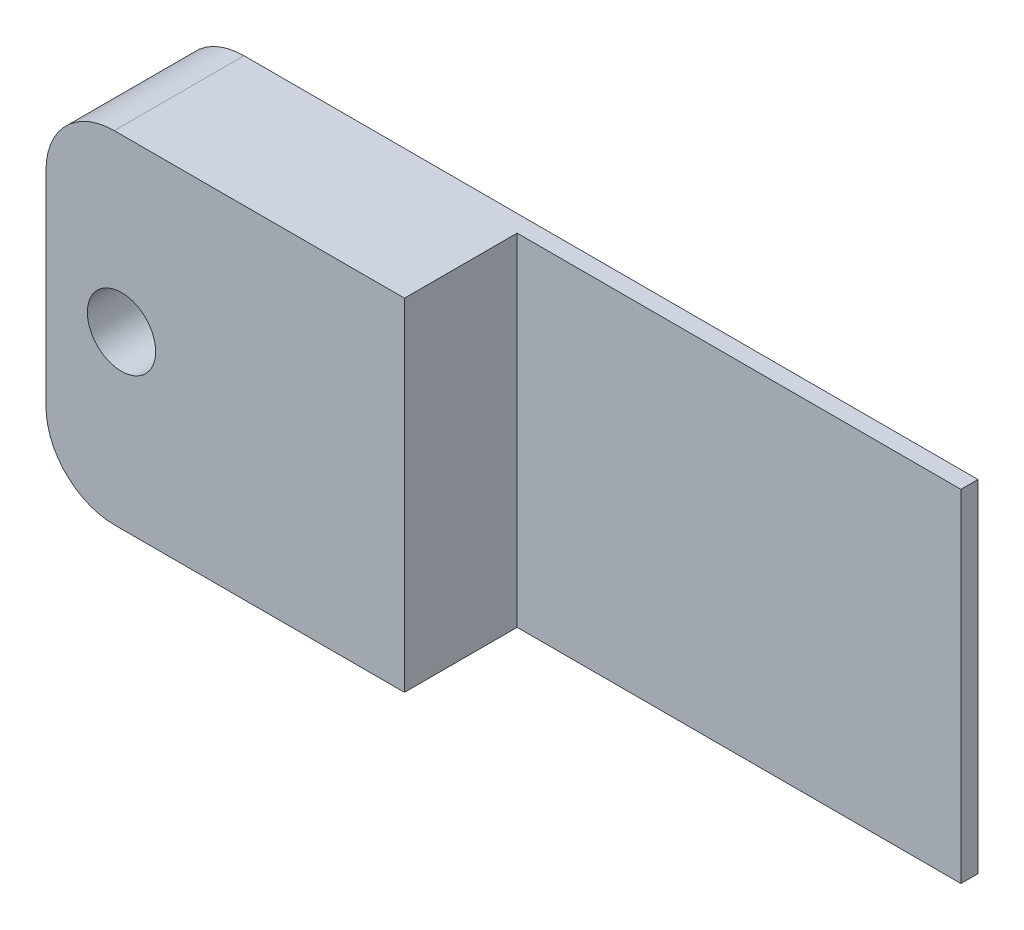
ISO-10303-21;
HEADER;
FILE_DESCRIPTION(('STEP AP214'),'2;1');
FILE_NAME('part.step','',(''),(''),'','','');
FILE_SCHEMA(('AUTOMOTIVE_DESIGN { 1 0 10303 214 1 1 1 1 }'));
ENDSEC;
DATA;
#1=APPLICATION_CONTEXT('core data for automotive mechanical design processes');
#2=APPLICATION_PROTOCOL_DEFINITION('international standard','automotive_design',2000,#1);
#3=PRODUCT_CONTEXT('',#1,'mechanical');
#4=PRODUCT('Part','Part','',(#3));
#5=PRODUCT_RELATED_PRODUCT_CATEGORY('part','',(#4));
#6=PRODUCT_DEFINITION_FORMATION('','',#4);
#7=PRODUCT_DEFINITION_CONTEXT('part definition',#1,'design');
#8=PRODUCT_DEFINITION('design','',#6,#7);
#9=PRODUCT_DEFINITION_SHAPE('','',#8);
#10=(LENGTH_UNIT() NAMED_UNIT(*) SI_UNIT(.MILLI.,.METRE.));
#11=(NAMED_UNIT(*) PLANE_ANGLE_UNIT() SI_UNIT($,.RADIAN.));
#12=(NAMED_UNIT(*) SI_UNIT($,.STERADIAN.) SOLID_ANGLE_UNIT());
#13=UNCERTAINTY_MEASURE_WITH_UNIT(LENGTH_MEASURE(1.E-05),#10,'distance_accuracy_value','');
#14=(GEOMETRIC_REPRESENTATION_CONTEXT(3) GLOBAL_UNCERTAINTY_ASSIGNED_CONTEXT((#13)) GLOBAL_UNIT_ASSIGNED_CONTEXT((#10,
#11,#12)) REPRESENTATION_CONTEXT('',''));
#15=CARTESIAN_POINT('',(0.,0.,0.));
#16=DIRECTION('',(0.,0.,1.));
#17=DIRECTION('',(1.,0.,0.));
#18=AXIS2_PLACEMENT_3D('',#15,#16,#17);
#19=CARTESIAN_POINT('',(-9.75,-3.,3.8));
#20=DIRECTION('',(0.,0.,1.));
#21=DIRECTION('',(1.,0.,0.));
#22=AXIS2_PLACEMENT_3D('',#19,#20,#21);
#23=PLANE('',#22);
#24=DIRECTION('',(0.,-1.,0.));
#25=VECTOR('',#24,1.);
#26=CARTESIAN_POINT('',(-1.25,5.,3.8));
#27=LINE('',#26,#25);
#28=CARTESIAN_POINT('',(-1.25,5.,3.8));
#29=VERTEX_POINT('',#28);
#30=CARTESIAN_POINT('',(-1.25,-5.,3.8));
#31=VERTEX_POINT('',#30);
#32=EDGE_CURVE('E113',#29,#31,#27,.T.);
#33=ORIENTED_EDGE('',*,*,#32,.F.);
#34=DIRECTION('',(-1.,0.,0.));
#35=VECTOR('',#34,1.);
#36=CARTESIAN_POINT('',(-9.74999999999999,5.,3.8));
#37=LINE('',#36,#35);
#38=CARTESIAN_POINT('',(-9.74999999999999,5.,3.8));
#39=VERTEX_POINT('',#38);
#40=EDGE_CURVE('E91',#29,#39,#37,.T.);
#41=ORIENTED_EDGE('',*,*,#40,.T.);
#42=CARTESIAN_POINT('',(-9.75,3.,3.8));
#43=DIRECTION('',(0.,0.,1.));
#44=DIRECTION('',(1.,0.,0.));
#45=AXIS2_PLACEMENT_3D('',#42,#43,#44);
#46=CIRCLE('',#45,2.);
#47=CARTESIAN_POINT('',(-11.75,2.99999999999999,3.8));
#48=VERTEX_POINT('',#47);
#49=EDGE_CURVE('E158',#39,#48,#46,.T.);
#50=ORIENTED_EDGE('',*,*,#49,.T.);
#51=DIRECTION('',(0.,-1.,0.));
#52=VECTOR('',#51,1.);
#53=CARTESIAN_POINT('',(-11.75,2.99999999999999,3.8));
#54=LINE('',#53,#52);
#55=CARTESIAN_POINT('',(-11.75,-2.99999999999998,3.8));
#56=VERTEX_POINT('',#55);
#57=EDGE_CURVE('E170',#48,#56,#54,.T.);
#58=ORIENTED_EDGE('',*,*,#57,.T.);
#59=CARTESIAN_POINT('',(-9.75,-3.,3.8));
#60=DIRECTION('',(0.,0.,1.));
#61=DIRECTION('',(1.,0.,0.));
#62=AXIS2_PLACEMENT_3D('',#59,#60,#61);
#63=CIRCLE('',#62,2.);
#64=CARTESIAN_POINT('',(-9.74999999999999,-5.,3.8));
#65=VERTEX_POINT('',#64);
#66=EDGE_CURVE('E57',#56,#65,#63,.T.);
#67=ORIENTED_EDGE('',*,*,#66,.T.);
#68=DIRECTION('',(1.,0.,0.));
#69=VECTOR('',#68,1.);
#70=CARTESIAN_POINT('',(-9.74999999999999,-5.,3.8));
#71=LINE('',#70,#69);
#72=EDGE_CURVE('E133',#65,#31,#71,.T.);
#73=ORIENTED_EDGE('',*,*,#72,.T.);
#74=EDGE_LOOP('',(#33,#41,#50,#58,#67,#73));
#75=FACE_BOUND('',#74,.T.);
#76=CARTESIAN_POINT('',(-9.53846153846155,0.,3.8));
#77=DIRECTION('',(0.,0.,1.));
#78=DIRECTION('',(1.,0.,0.));
#79=AXIS2_PLACEMENT_3D('',#76,#77,#78);
#80=CIRCLE('',#79,1.);
#81=CARTESIAN_POINT('',(-8.53846153846155,0.,3.8));
#82=VERTEX_POINT('',#81);
#83=EDGE_CURVE('E125',#82,#82,#80,.T.);
#84=ORIENTED_EDGE('',*,*,#83,.F.);
#85=EDGE_LOOP('',(#84));
#86=FACE_BOUND('',#85,.T.);
#87=ADVANCED_FACE('F33',(#75,#86),#23,.T.);
#88=CARTESIAN_POINT('',(-9.75,-3.,0.));
#89=DIRECTION('',(0.,0.,1.));
#90=DIRECTION('',(1.,0.,0.));
#91=AXIS2_PLACEMENT_3D('',#88,#89,#90);
#92=PLANE('',#91);
#93=DIRECTION('',(0.,1.,0.));
#94=VECTOR('',#93,1.);
#95=CARTESIAN_POINT('',(11.75,5.,0.));
#96=LINE('',#95,#94);
#97=CARTESIAN_POINT('',(11.75,-5.,0.));
#98=VERTEX_POINT('',#97);
#99=CARTESIAN_POINT('',(11.75,5.,0.));
#100=VERTEX_POINT('',#99);
#101=EDGE_CURVE('E121',#98,#100,#96,.T.);
#102=ORIENTED_EDGE('',*,*,#101,.F.);
#103=DIRECTION('',(1.,0.,0.));
#104=VECTOR('',#103,1.);
#105=CARTESIAN_POINT('',(-9.74999999999999,-5.,0.));
#106=LINE('',#105,#104);
#107=CARTESIAN_POINT('',(-9.74999999999999,-5.,0.));
#108=VERTEX_POINT('',#107);
#109=EDGE_CURVE('E141',#108,#98,#106,.T.);
#110=ORIENTED_EDGE('',*,*,#109,.F.);
#111=CARTESIAN_POINT('',(-9.75,-3.,0.));
#112=DIRECTION('',(0.,0.,1.));
#113=DIRECTION('',(1.,0.,0.));
#114=AXIS2_PLACEMENT_3D('',#111,#112,#113);
#115=CIRCLE('',#114,2.);
#116=CARTESIAN_POINT('',(-11.75,-2.99999999999998,0.));
#117=VERTEX_POINT('',#116);
#118=EDGE_CURVE('E139',#117,#108,#115,.T.);
#119=ORIENTED_EDGE('',*,*,#118,.F.);
#120=DIRECTION('',(0.,-1.,0.));
#121=VECTOR('',#120,1.);
#122=CARTESIAN_POINT('',(-11.75,2.99999999999999,0.));
#123=LINE('',#122,#121);
#124=CARTESIAN_POINT('',(-11.75,2.99999999999999,0.));
#125=VERTEX_POINT('',#124);
#126=EDGE_CURVE('E137',#125,#117,#123,.T.);
#127=ORIENTED_EDGE('',*,*,#126,.F.);
#128=CARTESIAN_POINT('',(-9.75,3.,0.));
#129=DIRECTION('',(0.,0.,1.));
#130=DIRECTION('',(1.,0.,0.));
#131=AXIS2_PLACEMENT_3D('',#128,#129,#130);
#132=CIRCLE('',#131,2.);
#133=CARTESIAN_POINT('',(-9.74999999999999,5.,0.));
#134=VERTEX_POINT('',#133);
#135=EDGE_CURVE('E127',#134,#125,#132,.T.);
#136=ORIENTED_EDGE('',*,*,#135,.F.);
#137=DIRECTION('',(-1.,0.,0.));
#138=VECTOR('',#137,1.);
#139=CARTESIAN_POINT('',(-9.74999999999999,5.,0.));
#140=LINE('',#139,#138);
#141=EDGE_CURVE('E124',#100,#134,#140,.T.);
#142=ORIENTED_EDGE('',*,*,#141,.F.);
#143=EDGE_LOOP('',(#102,#110,#119,#127,#136,#142));
#144=FACE_BOUND('',#143,.T.);
#145=CARTESIAN_POINT('',(-9.53846153846155,0.,0.));
#146=DIRECTION('',(0.,0.,1.));
#147=DIRECTION('',(1.,0.,0.));
#148=AXIS2_PLACEMENT_3D('',#145,#146,#147);
#149=CIRCLE('',#148,1.);
#150=CARTESIAN_POINT('',(-8.53846153846155,0.,0.));
#151=VERTEX_POINT('',#150);
#152=EDGE_CURVE('E130',#151,#151,#149,.T.);
#153=ORIENTED_EDGE('',*,*,#152,.T.);
#154=EDGE_LOOP('',(#153));
#155=FACE_BOUND('',#154,.T.);
#156=ADVANCED_FACE('F160',(#144,#155),#92,.F.);
#157=CARTESIAN_POINT('',(11.75,5.,3.8));
#158=DIRECTION('',(-1.,0.,0.));
#159=DIRECTION('',(0.,0.,1.));
#160=AXIS2_PLACEMENT_3D('',#157,#158,#159);
#161=PLANE('',#160);
#162=DIRECTION('',(0.,0.,-1.));
#163=VECTOR('',#162,1.);
#164=CARTESIAN_POINT('',(11.75,5.,3.8));
#165=LINE('',#164,#163);
#166=CARTESIAN_POINT('',(11.75,5.,0.5));
#167=VERTEX_POINT('',#166);
#168=EDGE_CURVE('E11',#167,#100,#165,.T.);
#169=ORIENTED_EDGE('',*,*,#168,.F.);
#170=DIRECTION('',(0.,1.,0.));
#171=VECTOR('',#170,1.);
#172=CARTESIAN_POINT('',(11.75,5.,0.5));
#173=LINE('',#172,#171);
#174=CARTESIAN_POINT('',(11.75,-5.,0.5));
#175=VERTEX_POINT('',#174);
#176=EDGE_CURVE('E105',#175,#167,#173,.T.);
#177=ORIENTED_EDGE('',*,*,#176,.F.);
#178=DIRECTION('',(0.,0.,-1.));
#179=VECTOR('',#178,1.);
#180=CARTESIAN_POINT('',(11.75,-5.,3.8));
#181=LINE('',#180,#179);
#182=EDGE_CURVE('E84',#175,#98,#181,.T.);
#183=ORIENTED_EDGE('',*,*,#182,.T.);
#184=ORIENTED_EDGE('',*,*,#101,.T.);
#185=EDGE_LOOP('',(#169,#177,#183,#184));
#186=FACE_BOUND('',#185,.T.);
#187=ADVANCED_FACE('F35',(#186),#161,.F.);
#188=CARTESIAN_POINT('',(-9.74999999999999,5.,3.8));
#189=DIRECTION('',(0.,-1.,0.));
#190=DIRECTION('',(0.,0.,-1.));
#191=AXIS2_PLACEMENT_3D('',#188,#189,#190);
#192=PLANE('',#191);
#193=ORIENTED_EDGE('',*,*,#40,.F.);
#194=DIRECTION('',(0.,0.,1.));
#195=VECTOR('',#194,1.);
#196=CARTESIAN_POINT('',(-1.25,5.,0.5));
#197=LINE('',#196,#195);
#198=CARTESIAN_POINT('',(-1.25,5.,0.5));
#199=VERTEX_POINT('',#198);
#200=EDGE_CURVE('E118',#199,#29,#197,.T.);
#201=ORIENTED_EDGE('',*,*,#200,.F.);
#202=DIRECTION('',(-1.,0.,0.));
#203=VECTOR('',#202,1.);
#204=CARTESIAN_POINT('',(11.75,5.,0.5));
#205=LINE('',#204,#203);
#206=EDGE_CURVE('E108',#167,#199,#205,.T.);
#207=ORIENTED_EDGE('',*,*,#206,.F.);
#208=ORIENTED_EDGE('',*,*,#168,.T.);
#209=ORIENTED_EDGE('',*,*,#141,.T.);
#210=DIRECTION('',(0.,0.,-1.));
#211=VECTOR('',#210,1.);
#212=CARTESIAN_POINT('',(-9.74999999999999,5.,3.8));
#213=LINE('',#212,#211);
#214=EDGE_CURVE('E41',#39,#134,#213,.T.);
#215=ORIENTED_EDGE('',*,*,#214,.F.);
#216=EDGE_LOOP('',(#193,#201,#207,#208,#209,#215));
#217=FACE_BOUND('',#216,.T.);
#218=ADVANCED_FACE('F116',(#217),#192,.F.);
#219=CARTESIAN_POINT('',(-9.75,3.,3.8));
#220=DIRECTION('',(0.,0.,-1.));
#221=DIRECTION('',(-1.,0.,0.));
#222=AXIS2_PLACEMENT_3D('',#219,#220,#221);
#223=CYLINDRICAL_SURFACE('',#222,2.);
#224=ORIENTED_EDGE('',*,*,#135,.T.);
#225=DIRECTION('',(0.,0.,-1.));
#226=VECTOR('',#225,1.);
#227=CARTESIAN_POINT('',(-11.75,2.99999999999999,3.8));
#228=LINE('',#227,#226);
#229=EDGE_CURVE('E150',#48,#125,#228,.T.);
#230=ORIENTED_EDGE('',*,*,#229,.F.);
#231=ORIENTED_EDGE('',*,*,#49,.F.);
#232=ORIENTED_EDGE('',*,*,#214,.T.);
#233=EDGE_LOOP('',(#224,#230,#231,#232));
#234=FACE_BOUND('',#233,.T.);
#235=ADVANCED_FACE('F156',(#234),#223,.T.);
#236=CARTESIAN_POINT('',(-11.75,2.99999999999999,3.8));
#237=DIRECTION('',(1.,0.,0.));
#238=DIRECTION('',(0.,0.,-1.));
#239=AXIS2_PLACEMENT_3D('',#236,#237,#238);
#240=PLANE('',#239);
#241=ORIENTED_EDGE('',*,*,#126,.T.);
#242=DIRECTION('',(0.,0.,-1.));
#243=VECTOR('',#242,1.);
#244=CARTESIAN_POINT('',(-11.75,-2.99999999999998,3.8));
#245=LINE('',#244,#243);
#246=EDGE_CURVE('E147',#56,#117,#245,.T.);
#247=ORIENTED_EDGE('',*,*,#246,.F.);
#248=ORIENTED_EDGE('',*,*,#57,.F.);
#249=ORIENTED_EDGE('',*,*,#229,.T.);
#250=EDGE_LOOP('',(#241,#247,#248,#249));
#251=FACE_BOUND('',#250,.T.);
#252=ADVANCED_FACE('F165',(#251),#240,.F.);
#253=CARTESIAN_POINT('',(-9.75,-3.,3.8));
#254=DIRECTION('',(0.,0.,-1.));
#255=DIRECTION('',(-1.,0.,0.));
#256=AXIS2_PLACEMENT_3D('',#253,#254,#255);
#257=CYLINDRICAL_SURFACE('',#256,2.);
#258=ORIENTED_EDGE('',*,*,#118,.T.);
#259=DIRECTION('',(0.,0.,-1.));
#260=VECTOR('',#259,1.);
#261=CARTESIAN_POINT('',(-9.74999999999999,-5.,3.8));
#262=LINE('',#261,#260);
#263=EDGE_CURVE('E144',#65,#108,#262,.T.);
#264=ORIENTED_EDGE('',*,*,#263,.F.);
#265=ORIENTED_EDGE('',*,*,#66,.F.);
#266=ORIENTED_EDGE('',*,*,#246,.T.);
#267=EDGE_LOOP('',(#258,#264,#265,#266));
#268=FACE_BOUND('',#267,.T.);
#269=ADVANCED_FACE('F168',(#268),#257,.T.);
#270=CARTESIAN_POINT('',(-9.74999999999999,-5.,3.8));
#271=DIRECTION('',(0.,1.,0.));
#272=DIRECTION('',(0.,0.,1.));
#273=AXIS2_PLACEMENT_3D('',#270,#271,#272);
#274=PLANE('',#273);
#275=DIRECTION('',(1.,0.,0.));
#276=VECTOR('',#275,1.);
#277=CARTESIAN_POINT('',(11.75,-5.,0.5));
#278=LINE('',#277,#276);
#279=CARTESIAN_POINT('',(-1.25,-5.,0.5));
#280=VERTEX_POINT('',#279);
#281=EDGE_CURVE('E111',#280,#175,#278,.T.);
#282=ORIENTED_EDGE('',*,*,#281,.F.);
#283=DIRECTION('',(0.,0.,1.));
#284=VECTOR('',#283,1.);
#285=CARTESIAN_POINT('',(-1.25,-5.,0.5));
#286=LINE('',#285,#284);
#287=EDGE_CURVE('E176',#280,#31,#286,.T.);
#288=ORIENTED_EDGE('',*,*,#287,.T.);
#289=ORIENTED_EDGE('',*,*,#72,.F.);
#290=ORIENTED_EDGE('',*,*,#263,.T.);
#291=ORIENTED_EDGE('',*,*,#109,.T.);
#292=ORIENTED_EDGE('',*,*,#182,.F.);
#293=EDGE_LOOP('',(#282,#288,#289,#290,#291,#292));
#294=FACE_BOUND('',#293,.T.);
#295=ADVANCED_FACE('F186',(#294),#274,.F.);
#296=CARTESIAN_POINT('',(-9.53846153846155,0.,3.8));
#297=DIRECTION('',(0.,0.,-1.));
#298=DIRECTION('',(-1.,0.,0.));
#299=AXIS2_PLACEMENT_3D('',#296,#297,#298);
#300=CYLINDRICAL_SURFACE('',#299,1.);
#301=ORIENTED_EDGE('',*,*,#83,.T.);
#302=EDGE_LOOP('',(#301));
#303=FACE_BOUND('',#302,.T.);
#304=ORIENTED_EDGE('',*,*,#152,.F.);
#305=EDGE_LOOP('',(#304));
#306=FACE_BOUND('',#305,.T.);
#307=ADVANCED_FACE('F192',(#303,#306),#300,.F.);
#308=CARTESIAN_POINT('',(-1.25,5.,0.5));
#309=DIRECTION('',(-1.,0.,0.));
#310=DIRECTION('',(0.,-1.,0.));
#311=AXIS2_PLACEMENT_3D('',#308,#309,#310);
#312=PLANE('',#311);
#313=ORIENTED_EDGE('',*,*,#32,.T.);
#314=ORIENTED_EDGE('',*,*,#287,.F.);
#315=DIRECTION('',(0.,-1.,0.));
#316=VECTOR('',#315,1.);
#317=CARTESIAN_POINT('',(-1.25,5.,0.5));
#318=LINE('',#317,#316);
#319=EDGE_CURVE('E48',#199,#280,#318,.T.);
#320=ORIENTED_EDGE('',*,*,#319,.F.);
#321=ORIENTED_EDGE('',*,*,#200,.T.);
#322=EDGE_LOOP('',(#313,#314,#320,#321));
#323=FACE_BOUND('',#322,.T.);
#324=ADVANCED_FACE('F184',(#323),#312,.F.);
#325=CARTESIAN_POINT('',(0.,0.,0.5));
#326=DIRECTION('',(0.,0.,-1.));
#327=DIRECTION('',(-1.,0.,0.));
#328=AXIS2_PLACEMENT_3D('',#325,#326,#327);
#329=PLANE('',#328);
#330=ORIENTED_EDGE('',*,*,#176,.T.);
#331=ORIENTED_EDGE('',*,*,#206,.T.);
#332=ORIENTED_EDGE('',*,*,#319,.T.);
#333=ORIENTED_EDGE('',*,*,#281,.T.);
#334=EDGE_LOOP('',(#330,#331,#332,#333));
#335=FACE_BOUND('',#334,.T.);
#336=ADVANCED_FACE('F107',(#335),#329,.F.);
#337=CLOSED_SHELL('',(#87,#156,#187,#218,#235,#252,#269,#295,#307,#324,#336));
#338=MANIFOLD_SOLID_BREP('B2',#337);
#339=ADVANCED_BREP_SHAPE_REPRESENTATION('',(#18,#338),#14);
#340=SHAPE_DEFINITION_REPRESENTATION(#9,#339);
ENDSEC;
END-ISO-10303-21;
